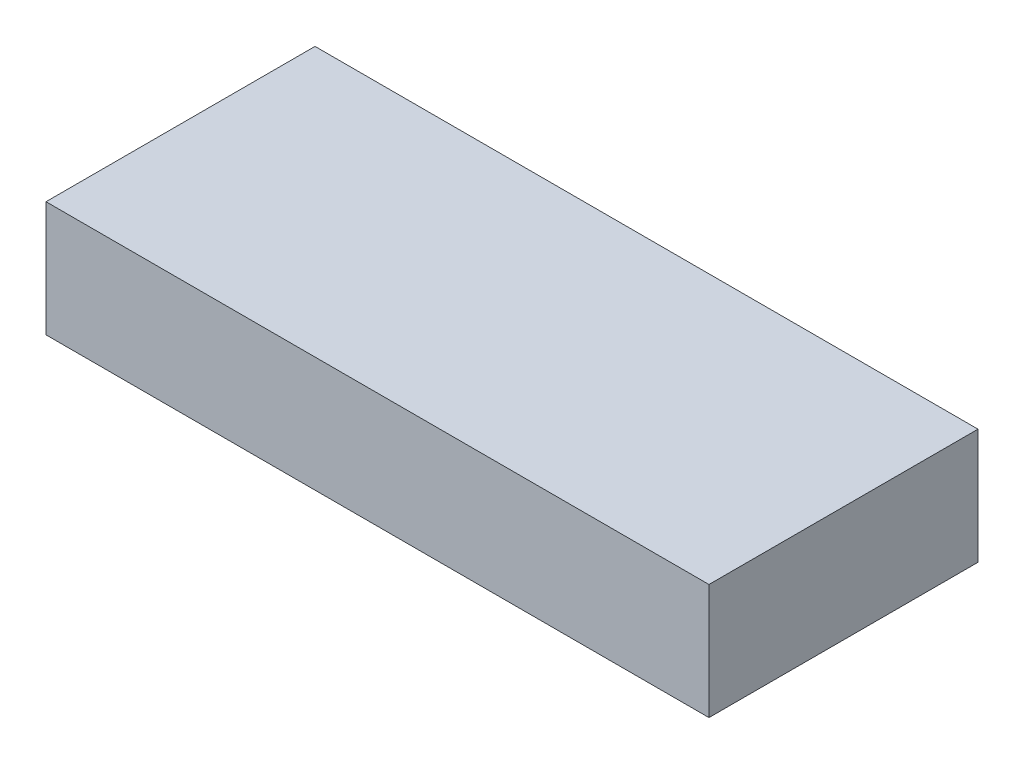
ISO-10303-21;
HEADER;
FILE_DESCRIPTION(('STEP AP214'),'2;1');
FILE_NAME('part.step','',(''),(''),'','','');
FILE_SCHEMA(('AUTOMOTIVE_DESIGN { 1 0 10303 214 1 1 1 1 }'));
ENDSEC;
DATA;
#1=APPLICATION_CONTEXT('core data for automotive mechanical design processes');
#2=APPLICATION_PROTOCOL_DEFINITION('international standard','automotive_design',2000,#1);
#3=PRODUCT_CONTEXT('',#1,'mechanical');
#4=PRODUCT('Part','Part','',(#3));
#5=PRODUCT_RELATED_PRODUCT_CATEGORY('part','',(#4));
#6=PRODUCT_DEFINITION_FORMATION('','',#4);
#7=PRODUCT_DEFINITION_CONTEXT('part definition',#1,'design');
#8=PRODUCT_DEFINITION('design','',#6,#7);
#9=PRODUCT_DEFINITION_SHAPE('','',#8);
#10=(LENGTH_UNIT() NAMED_UNIT(*) SI_UNIT(.MILLI.,.METRE.));
#11=(NAMED_UNIT(*) PLANE_ANGLE_UNIT() SI_UNIT($,.RADIAN.));
#12=(NAMED_UNIT(*) SI_UNIT($,.STERADIAN.) SOLID_ANGLE_UNIT());
#13=UNCERTAINTY_MEASURE_WITH_UNIT(LENGTH_MEASURE(1.E-05),#10,'distance_accuracy_value','');
#14=(GEOMETRIC_REPRESENTATION_CONTEXT(3) GLOBAL_UNCERTAINTY_ASSIGNED_CONTEXT((#13)) GLOBAL_UNIT_ASSIGNED_CONTEXT((#10,
#11,#12)) REPRESENTATION_CONTEXT('',''));
#15=CARTESIAN_POINT('',(0.,0.,0.));
#16=DIRECTION('',(0.,0.,1.));
#17=DIRECTION('',(1.,0.,0.));
#18=AXIS2_PLACEMENT_3D('',#15,#16,#17);
#19=CARTESIAN_POINT('',(0.,38.1,0.));
#20=DIRECTION('',(1.,0.,0.));
#21=DIRECTION('',(0.,0.,-1.));
#22=AXIS2_PLACEMENT_3D('',#19,#20,#21);
#23=PLANE('',#22);
#24=DIRECTION('',(0.,0.,1.));
#25=VECTOR('',#24,1.);
#26=CARTESIAN_POINT('',(0.,0.,0.));
#27=LINE('',#26,#25);
#28=CARTESIAN_POINT('',(0.,0.,-88.9));
#29=VERTEX_POINT('',#28);
#30=CARTESIAN_POINT('',(0.,0.,0.));
#31=VERTEX_POINT('',#30);
#32=EDGE_CURVE('E102',#29,#31,#27,.T.);
#33=ORIENTED_EDGE('',*,*,#32,.T.);
#34=DIRECTION('',(0.,-1.,0.));
#35=VECTOR('',#34,1.);
#36=CARTESIAN_POINT('',(0.,38.1,0.));
#37=LINE('',#36,#35);
#38=CARTESIAN_POINT('',(0.,38.1,0.));
#39=VERTEX_POINT('',#38);
#40=EDGE_CURVE('E11',#39,#31,#37,.T.);
#41=ORIENTED_EDGE('',*,*,#40,.F.);
#42=DIRECTION('',(0.,0.,1.));
#43=VECTOR('',#42,1.);
#44=CARTESIAN_POINT('',(0.,38.1,0.));
#45=LINE('',#44,#43);
#46=CARTESIAN_POINT('',(0.,38.1,-88.9));
#47=VERTEX_POINT('',#46);
#48=EDGE_CURVE('E90',#47,#39,#45,.T.);
#49=ORIENTED_EDGE('',*,*,#48,.F.);
#50=DIRECTION('',(0.,-1.,0.));
#51=VECTOR('',#50,1.);
#52=CARTESIAN_POINT('',(0.,38.1,-88.9));
#53=LINE('',#52,#51);
#54=EDGE_CURVE('E98',#47,#29,#53,.T.);
#55=ORIENTED_EDGE('',*,*,#54,.T.);
#56=EDGE_LOOP('',(#33,#41,#49,#55));
#57=FACE_BOUND('',#56,.T.);
#58=ADVANCED_FACE('F39',(#57),#23,.F.);
#59=CARTESIAN_POINT('',(0.,38.1,0.));
#60=DIRECTION('',(0.,0.,-1.));
#61=DIRECTION('',(-1.,0.,0.));
#62=AXIS2_PLACEMENT_3D('',#59,#60,#61);
#63=PLANE('',#62);
#64=DIRECTION('',(1.,0.,0.));
#65=VECTOR('',#64,1.);
#66=CARTESIAN_POINT('',(0.,0.,0.));
#67=LINE('',#66,#65);
#68=CARTESIAN_POINT('',(219.075,0.,0.));
#69=VERTEX_POINT('',#68);
#70=EDGE_CURVE('E94',#31,#69,#67,.T.);
#71=ORIENTED_EDGE('',*,*,#70,.T.);
#72=DIRECTION('',(0.,-1.,0.));
#73=VECTOR('',#72,1.);
#74=CARTESIAN_POINT('',(219.075,38.1,0.));
#75=LINE('',#74,#73);
#76=CARTESIAN_POINT('',(219.075,38.1,0.));
#77=VERTEX_POINT('',#76);
#78=EDGE_CURVE('E47',#77,#69,#75,.T.);
#79=ORIENTED_EDGE('',*,*,#78,.F.);
#80=DIRECTION('',(1.,0.,0.));
#81=VECTOR('',#80,1.);
#82=CARTESIAN_POINT('',(0.,38.1,0.));
#83=LINE('',#82,#81);
#84=EDGE_CURVE('E85',#39,#77,#83,.T.);
#85=ORIENTED_EDGE('',*,*,#84,.F.);
#86=ORIENTED_EDGE('',*,*,#40,.T.);
#87=EDGE_LOOP('',(#71,#79,#85,#86));
#88=FACE_BOUND('',#87,.T.);
#89=ADVANCED_FACE('F93',(#88),#63,.F.);
#90=CARTESIAN_POINT('',(219.075,38.1,0.));
#91=DIRECTION('',(-1.,0.,0.));
#92=DIRECTION('',(0.,0.,1.));
#93=AXIS2_PLACEMENT_3D('',#90,#91,#92);
#94=PLANE('',#93);
#95=DIRECTION('',(0.,0.,-1.));
#96=VECTOR('',#95,1.);
#97=CARTESIAN_POINT('',(219.075,0.,0.));
#98=LINE('',#97,#96);
#99=CARTESIAN_POINT('',(219.075,0.,-88.9));
#100=VERTEX_POINT('',#99);
#101=EDGE_CURVE('E72',#69,#100,#98,.T.);
#102=ORIENTED_EDGE('',*,*,#101,.T.);
#103=DIRECTION('',(0.,-1.,0.));
#104=VECTOR('',#103,1.);
#105=CARTESIAN_POINT('',(219.075,38.1,-88.9));
#106=LINE('',#105,#104);
#107=CARTESIAN_POINT('',(219.075,38.1,-88.9));
#108=VERTEX_POINT('',#107);
#109=EDGE_CURVE('E95',#108,#100,#106,.T.);
#110=ORIENTED_EDGE('',*,*,#109,.F.);
#111=DIRECTION('',(0.,0.,-1.));
#112=VECTOR('',#111,1.);
#113=CARTESIAN_POINT('',(219.075,38.1,0.));
#114=LINE('',#113,#112);
#115=EDGE_CURVE('E88',#77,#108,#114,.T.);
#116=ORIENTED_EDGE('',*,*,#115,.F.);
#117=ORIENTED_EDGE('',*,*,#78,.T.);
#118=EDGE_LOOP('',(#102,#110,#116,#117));
#119=FACE_BOUND('',#118,.T.);
#120=ADVANCED_FACE('F96',(#119),#94,.F.);
#121=CARTESIAN_POINT('',(0.,38.1,-88.9));
#122=DIRECTION('',(0.,0.,1.));
#123=DIRECTION('',(1.,0.,0.));
#124=AXIS2_PLACEMENT_3D('',#121,#122,#123);
#125=PLANE('',#124);
#126=DIRECTION('',(-1.,0.,0.));
#127=VECTOR('',#126,1.);
#128=CARTESIAN_POINT('',(0.,0.,-88.9));
#129=LINE('',#128,#127);
#130=EDGE_CURVE('E78',#100,#29,#129,.T.);
#131=ORIENTED_EDGE('',*,*,#130,.T.);
#132=ORIENTED_EDGE('',*,*,#54,.F.);
#133=DIRECTION('',(-1.,0.,0.));
#134=VECTOR('',#133,1.);
#135=CARTESIAN_POINT('',(0.,38.1,-88.9));
#136=LINE('',#135,#134);
#137=EDGE_CURVE('E55',#108,#47,#136,.T.);
#138=ORIENTED_EDGE('',*,*,#137,.F.);
#139=ORIENTED_EDGE('',*,*,#109,.T.);
#140=EDGE_LOOP('',(#131,#132,#138,#139));
#141=FACE_BOUND('',#140,.T.);
#142=ADVANCED_FACE('F109',(#141),#125,.F.);
#143=CARTESIAN_POINT('',(0.,38.1,0.));
#144=DIRECTION('',(0.,-1.,0.));
#145=DIRECTION('',(0.,0.,-1.));
#146=AXIS2_PLACEMENT_3D('',#143,#144,#145);
#147=PLANE('',#146);
#148=ORIENTED_EDGE('',*,*,#48,.T.);
#149=ORIENTED_EDGE('',*,*,#84,.T.);
#150=ORIENTED_EDGE('',*,*,#115,.T.);
#151=ORIENTED_EDGE('',*,*,#137,.T.);
#152=EDGE_LOOP('',(#148,#149,#150,#151));
#153=FACE_BOUND('',#152,.T.);
#154=ADVANCED_FACE('F86',(#153),#147,.F.);
#155=CARTESIAN_POINT('',(0.,0.,0.));
#156=DIRECTION('',(0.,-1.,0.));
#157=DIRECTION('',(0.,0.,-1.));
#158=AXIS2_PLACEMENT_3D('',#155,#156,#157);
#159=PLANE('',#158);
#160=ORIENTED_EDGE('',*,*,#32,.F.);
#161=ORIENTED_EDGE('',*,*,#130,.F.);
#162=ORIENTED_EDGE('',*,*,#101,.F.);
#163=ORIENTED_EDGE('',*,*,#70,.F.);
#164=EDGE_LOOP('',(#160,#161,#162,#163));
#165=FACE_BOUND('',#164,.T.);
#166=ADVANCED_FACE('F112',(#165),#159,.T.);
#167=CLOSED_SHELL('',(#58,#89,#120,#142,#154,#166));
#168=MANIFOLD_SOLID_BREP('B2',#167);
#169=ADVANCED_BREP_SHAPE_REPRESENTATION('',(#18,#168),#14);
#170=SHAPE_DEFINITION_REPRESENTATION(#9,#169);
ENDSEC;
END-ISO-10303-21;
